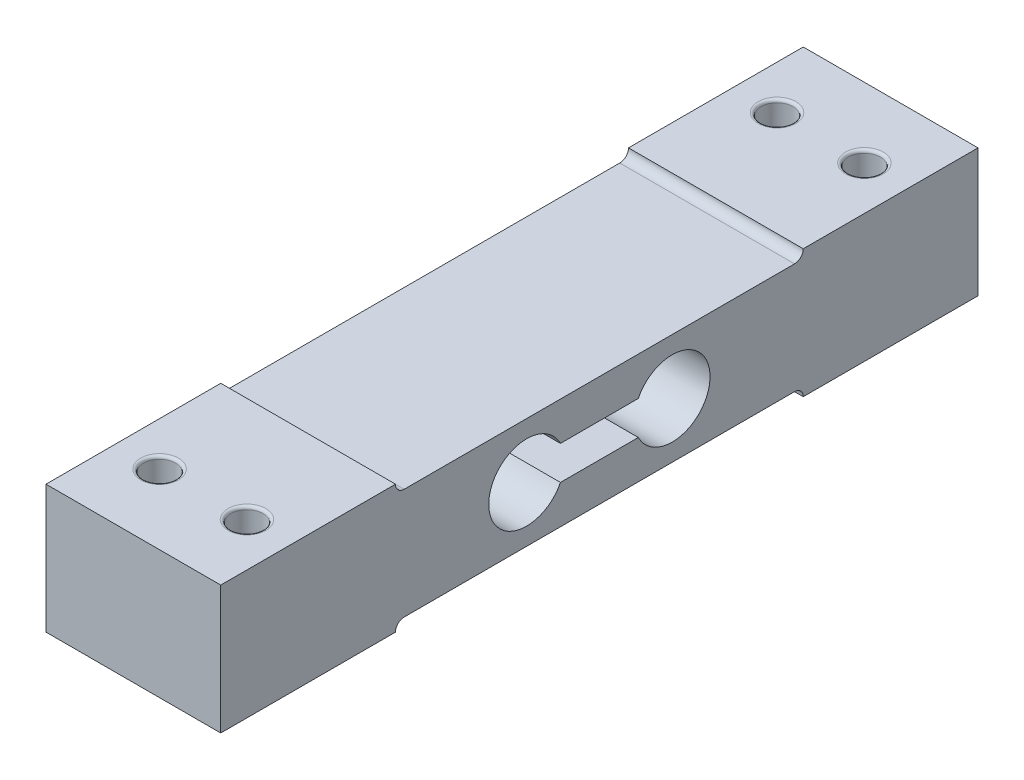
ISO-10303-21;
HEADER;
FILE_DESCRIPTION(('STEP AP214'),'2;1');
FILE_NAME('part.step','',(''),(''),'','','');
FILE_SCHEMA(('AUTOMOTIVE_DESIGN { 1 0 10303 214 1 1 1 1 }'));
ENDSEC;
DATA;
#1=APPLICATION_CONTEXT('core data for automotive mechanical design processes');
#2=APPLICATION_PROTOCOL_DEFINITION('international standard','automotive_design',2000,#1);
#3=PRODUCT_CONTEXT('',#1,'mechanical');
#4=PRODUCT('Part','Part','',(#3));
#5=PRODUCT_RELATED_PRODUCT_CATEGORY('part','',(#4));
#6=PRODUCT_DEFINITION_FORMATION('','',#4);
#7=PRODUCT_DEFINITION_CONTEXT('part definition',#1,'design');
#8=PRODUCT_DEFINITION('design','',#6,#7);
#9=PRODUCT_DEFINITION_SHAPE('','',#8);
#10=(LENGTH_UNIT() NAMED_UNIT(*) SI_UNIT(.MILLI.,.METRE.));
#11=(NAMED_UNIT(*) PLANE_ANGLE_UNIT() SI_UNIT($,.RADIAN.));
#12=(NAMED_UNIT(*) SI_UNIT($,.STERADIAN.) SOLID_ANGLE_UNIT());
#13=UNCERTAINTY_MEASURE_WITH_UNIT(LENGTH_MEASURE(1.E-05),#10,'distance_accuracy_value','');
#14=(GEOMETRIC_REPRESENTATION_CONTEXT(3) GLOBAL_UNCERTAINTY_ASSIGNED_CONTEXT((#13)) GLOBAL_UNIT_ASSIGNED_CONTEXT((#10,
#11,#12)) REPRESENTATION_CONTEXT('',''));
#15=CARTESIAN_POINT('',(0.,0.,0.));
#16=DIRECTION('',(0.,0.,1.));
#17=DIRECTION('',(1.,0.,0.));
#18=AXIS2_PLACEMENT_3D('',#15,#16,#17);
#19=CARTESIAN_POINT('',(30.,0.,-12.5));
#20=DIRECTION('',(-1.,0.,0.));
#21=DIRECTION('',(0.,0.,1.));
#22=AXIS2_PLACEMENT_3D('',#19,#20,#21);
#23=CYLINDRICAL_SURFACE('',#22,6.5);
#24=CARTESIAN_POINT('',(0.,0.,-12.5));
#25=DIRECTION('',(1.,0.,0.));
#26=DIRECTION('',(0.,0.,-1.));
#27=AXIS2_PLACEMENT_3D('',#24,#25,#26);
#28=CIRCLE('',#27,6.5);
#29=CARTESIAN_POINT('',(0.,-2.9,-6.68278417110041));
#30=VERTEX_POINT('',#29);
#31=CARTESIAN_POINT('',(0.,2.9,-6.68278417110041));
#32=VERTEX_POINT('',#31);
#33=EDGE_CURVE('E400',#30,#32,#28,.T.);
#34=ORIENTED_EDGE('',*,*,#33,.F.);
#35=DIRECTION('',(-1.,0.,0.));
#36=VECTOR('',#35,1.);
#37=CARTESIAN_POINT('',(30.,-2.9,-6.68278417110041));
#38=LINE('',#37,#36);
#39=CARTESIAN_POINT('',(30.,-2.9,-6.68278417110041));
#40=VERTEX_POINT('',#39);
#41=EDGE_CURVE('E182',#40,#30,#38,.T.);
#42=ORIENTED_EDGE('',*,*,#41,.F.);
#43=CARTESIAN_POINT('',(30.,0.,-12.5));
#44=DIRECTION('',(1.,0.,0.));
#45=DIRECTION('',(0.,0.,-1.));
#46=AXIS2_PLACEMENT_3D('',#43,#44,#45);
#47=CIRCLE('',#46,6.5);
#48=CARTESIAN_POINT('',(30.,2.9,-6.68278417110041));
#49=VERTEX_POINT('',#48);
#50=EDGE_CURVE('E427',#40,#49,#47,.T.);
#51=ORIENTED_EDGE('',*,*,#50,.T.);
#52=DIRECTION('',(-1.,0.,0.));
#53=VECTOR('',#52,1.);
#54=CARTESIAN_POINT('',(30.,2.9,-6.68278417110041));
#55=LINE('',#54,#53);
#56=EDGE_CURVE('E171',#49,#32,#55,.T.);
#57=ORIENTED_EDGE('',*,*,#56,.T.);
#58=EDGE_LOOP('',(#34,#42,#51,#57));
#59=FACE_BOUND('',#58,.T.);
#60=ADVANCED_FACE('F34',(#59),#23,.F.);
#61=CARTESIAN_POINT('',(30.,-2.9,0.));
#62=DIRECTION('',(0.,1.,0.));
#63=DIRECTION('',(0.,0.,1.));
#64=AXIS2_PLACEMENT_3D('',#61,#62,#63);
#65=PLANE('',#64);
#66=DIRECTION('',(0.,0.,-1.));
#67=VECTOR('',#66,1.);
#68=CARTESIAN_POINT('',(0.,-2.9,0.));
#69=LINE('',#68,#67);
#70=CARTESIAN_POINT('',(0.,-2.9,6.68278417110041));
#71=VERTEX_POINT('',#70);
#72=EDGE_CURVE('E403',#71,#30,#69,.T.);
#73=ORIENTED_EDGE('',*,*,#72,.F.);
#74=DIRECTION('',(-1.,0.,0.));
#75=VECTOR('',#74,1.);
#76=CARTESIAN_POINT('',(30.,-2.9,6.68278417110041));
#77=LINE('',#76,#75);
#78=CARTESIAN_POINT('',(30.,-2.9,6.68278417110041));
#79=VERTEX_POINT('',#78);
#80=EDGE_CURVE('E411',#79,#71,#77,.T.);
#81=ORIENTED_EDGE('',*,*,#80,.F.);
#82=DIRECTION('',(0.,0.,-1.));
#83=VECTOR('',#82,1.);
#84=CARTESIAN_POINT('',(30.,-2.9,0.));
#85=LINE('',#84,#83);
#86=EDGE_CURVE('E418',#79,#40,#85,.T.);
#87=ORIENTED_EDGE('',*,*,#86,.T.);
#88=ORIENTED_EDGE('',*,*,#41,.T.);
#89=EDGE_LOOP('',(#73,#81,#87,#88));
#90=FACE_BOUND('',#89,.T.);
#91=ADVANCED_FACE('F255',(#90),#65,.T.);
#92=CARTESIAN_POINT('',(30.,0.,12.5));
#93=DIRECTION('',(-1.,0.,0.));
#94=DIRECTION('',(0.,0.,1.));
#95=AXIS2_PLACEMENT_3D('',#92,#93,#94);
#96=CYLINDRICAL_SURFACE('',#95,6.5);
#97=CARTESIAN_POINT('',(0.,0.,12.5));
#98=DIRECTION('',(1.,0.,0.));
#99=DIRECTION('',(0.,0.,-1.));
#100=AXIS2_PLACEMENT_3D('',#97,#98,#99);
#101=CIRCLE('',#100,6.5);
#102=CARTESIAN_POINT('',(0.,2.9,6.6827841711004));
#103=VERTEX_POINT('',#102);
#104=EDGE_CURVE('E406',#103,#71,#101,.T.);
#105=ORIENTED_EDGE('',*,*,#104,.F.);
#106=DIRECTION('',(-1.,0.,0.));
#107=VECTOR('',#106,1.);
#108=CARTESIAN_POINT('',(30.,2.9,6.6827841711004));
#109=LINE('',#108,#107);
#110=CARTESIAN_POINT('',(30.,2.9,6.6827841711004));
#111=VERTEX_POINT('',#110);
#112=EDGE_CURVE('E173',#111,#103,#109,.T.);
#113=ORIENTED_EDGE('',*,*,#112,.F.);
#114=CARTESIAN_POINT('',(30.,0.,12.5));
#115=DIRECTION('',(1.,0.,0.));
#116=DIRECTION('',(0.,0.,-1.));
#117=AXIS2_PLACEMENT_3D('',#114,#115,#116);
#118=CIRCLE('',#117,6.5);
#119=EDGE_CURVE('E362',#111,#79,#118,.T.);
#120=ORIENTED_EDGE('',*,*,#119,.T.);
#121=ORIENTED_EDGE('',*,*,#80,.T.);
#122=EDGE_LOOP('',(#105,#113,#120,#121));
#123=FACE_BOUND('',#122,.T.);
#124=ADVANCED_FACE('F261',(#123),#96,.F.);
#125=CARTESIAN_POINT('',(30.,11.,0.));
#126=DIRECTION('',(0.,1.,0.));
#127=DIRECTION('',(0.,0.,1.));
#128=AXIS2_PLACEMENT_3D('',#125,#126,#127);
#129=PLANE('',#128);
#130=CARTESIAN_POINT('',(22.5,11.,53.));
#131=DIRECTION('',(0.,1.,0.));
#132=DIRECTION('',(0.,0.,1.));
#133=AXIS2_PLACEMENT_3D('',#130,#131,#132);
#134=CIRCLE('',#133,3.25);
#135=CARTESIAN_POINT('',(22.5,11.,56.25));
#136=VERTEX_POINT('',#135);
#137=EDGE_CURVE('E11',#136,#136,#134,.F.);
#138=ORIENTED_EDGE('',*,*,#137,.T.);
#139=EDGE_LOOP('',(#138));
#140=FACE_BOUND('',#139,.T.);
#141=CARTESIAN_POINT('',(7.5,11.,53.));
#142=DIRECTION('',(0.,1.,0.));
#143=DIRECTION('',(0.,0.,1.));
#144=AXIS2_PLACEMENT_3D('',#141,#142,#143);
#145=CIRCLE('',#144,3.25);
#146=CARTESIAN_POINT('',(7.5,11.,56.25));
#147=VERTEX_POINT('',#146);
#148=EDGE_CURVE('E42',#147,#147,#145,.F.);
#149=ORIENTED_EDGE('',*,*,#148,.T.);
#150=EDGE_LOOP('',(#149));
#151=FACE_BOUND('',#150,.T.);
#152=DIRECTION('',(0.,0.,-1.));
#153=VECTOR('',#152,1.);
#154=CARTESIAN_POINT('',(0.,11.,0.));
#155=LINE('',#154,#153);
#156=CARTESIAN_POINT('',(0.,11.,65.));
#157=VERTEX_POINT('',#156);
#158=CARTESIAN_POINT('',(0.,11.,35.));
#159=VERTEX_POINT('',#158);
#160=EDGE_CURVE('E391',#157,#159,#155,.T.);
#161=ORIENTED_EDGE('',*,*,#160,.F.);
#162=DIRECTION('',(-1.,0.,0.));
#163=VECTOR('',#162,1.);
#164=CARTESIAN_POINT('',(30.,11.,65.));
#165=LINE('',#164,#163);
#166=CARTESIAN_POINT('',(30.,11.,65.));
#167=VERTEX_POINT('',#166);
#168=EDGE_CURVE('E165',#167,#157,#165,.T.);
#169=ORIENTED_EDGE('',*,*,#168,.F.);
#170=DIRECTION('',(0.,0.,-1.));
#171=VECTOR('',#170,1.);
#172=CARTESIAN_POINT('',(30.,11.,0.));
#173=LINE('',#172,#171);
#174=CARTESIAN_POINT('',(30.,11.,35.));
#175=VERTEX_POINT('',#174);
#176=EDGE_CURVE('E152',#167,#175,#173,.T.);
#177=ORIENTED_EDGE('',*,*,#176,.T.);
#178=DIRECTION('',(-1.,0.,0.));
#179=VECTOR('',#178,1.);
#180=CARTESIAN_POINT('',(30.,11.,35.));
#181=LINE('',#180,#179);
#182=EDGE_CURVE('E163',#175,#159,#181,.T.);
#183=ORIENTED_EDGE('',*,*,#182,.T.);
#184=EDGE_LOOP('',(#161,#169,#177,#183));
#185=FACE_BOUND('',#184,.T.);
#186=ADVANCED_FACE('F162',(#140,#151,#185),#129,.T.);
#187=CARTESIAN_POINT('',(30.,0.,65.));
#188=DIRECTION('',(0.,0.,-1.));
#189=DIRECTION('',(-1.,0.,0.));
#190=AXIS2_PLACEMENT_3D('',#187,#188,#189);
#191=PLANE('',#190);
#192=DIRECTION('',(0.,-1.,0.));
#193=VECTOR('',#192,1.);
#194=CARTESIAN_POINT('',(0.,0.,65.));
#195=LINE('',#194,#193);
#196=CARTESIAN_POINT('',(0.,-11.,65.));
#197=VERTEX_POINT('',#196);
#198=EDGE_CURVE('E384',#157,#197,#195,.T.);
#199=ORIENTED_EDGE('',*,*,#198,.T.);
#200=DIRECTION('',(-1.,0.,0.));
#201=VECTOR('',#200,1.);
#202=CARTESIAN_POINT('',(30.,-11.,65.));
#203=LINE('',#202,#201);
#204=CARTESIAN_POINT('',(30.,-11.,65.));
#205=VERTEX_POINT('',#204);
#206=EDGE_CURVE('E175',#205,#197,#203,.T.);
#207=ORIENTED_EDGE('',*,*,#206,.F.);
#208=DIRECTION('',(0.,-1.,0.));
#209=VECTOR('',#208,1.);
#210=CARTESIAN_POINT('',(30.,0.,65.));
#211=LINE('',#210,#209);
#212=EDGE_CURVE('E167',#167,#205,#211,.T.);
#213=ORIENTED_EDGE('',*,*,#212,.F.);
#214=ORIENTED_EDGE('',*,*,#168,.T.);
#215=EDGE_LOOP('',(#199,#207,#213,#214));
#216=FACE_BOUND('',#215,.T.);
#217=ADVANCED_FACE('F290',(#216),#191,.F.);
#218=CARTESIAN_POINT('',(30.,-11.,0.));
#219=DIRECTION('',(0.,1.,0.));
#220=DIRECTION('',(0.,0.,1.));
#221=AXIS2_PLACEMENT_3D('',#218,#219,#220);
#222=PLANE('',#221);
#223=CARTESIAN_POINT('',(22.5,-11.,53.));
#224=DIRECTION('',(0.,1.,0.));
#225=DIRECTION('',(0.,0.,1.));
#226=AXIS2_PLACEMENT_3D('',#223,#224,#225);
#227=CIRCLE('',#226,3.25);
#228=CARTESIAN_POINT('',(22.5,-11.,56.25));
#229=VERTEX_POINT('',#228);
#230=EDGE_CURVE('E203',#229,#229,#227,.T.);
#231=ORIENTED_EDGE('',*,*,#230,.T.);
#232=EDGE_LOOP('',(#231));
#233=FACE_BOUND('',#232,.T.);
#234=CARTESIAN_POINT('',(7.5,-11.,53.));
#235=DIRECTION('',(0.,1.,0.));
#236=DIRECTION('',(0.,0.,1.));
#237=AXIS2_PLACEMENT_3D('',#234,#235,#236);
#238=CIRCLE('',#237,3.25);
#239=CARTESIAN_POINT('',(7.5,-11.,56.25));
#240=VERTEX_POINT('',#239);
#241=EDGE_CURVE('E156',#240,#240,#238,.T.);
#242=ORIENTED_EDGE('',*,*,#241,.T.);
#243=EDGE_LOOP('',(#242));
#244=FACE_BOUND('',#243,.T.);
#245=DIRECTION('',(0.,0.,-1.));
#246=VECTOR('',#245,1.);
#247=CARTESIAN_POINT('',(0.,-11.,0.));
#248=LINE('',#247,#246);
#249=CARTESIAN_POINT('',(0.,-11.,35.));
#250=VERTEX_POINT('',#249);
#251=EDGE_CURVE('E380',#197,#250,#248,.T.);
#252=ORIENTED_EDGE('',*,*,#251,.T.);
#253=DIRECTION('',(-1.,0.,0.));
#254=VECTOR('',#253,1.);
#255=CARTESIAN_POINT('',(30.,-11.,35.));
#256=LINE('',#255,#254);
#257=CARTESIAN_POINT('',(30.,-11.,35.));
#258=VERTEX_POINT('',#257);
#259=EDGE_CURVE('E371',#258,#250,#256,.T.);
#260=ORIENTED_EDGE('',*,*,#259,.F.);
#261=DIRECTION('',(0.,0.,-1.));
#262=VECTOR('',#261,1.);
#263=CARTESIAN_POINT('',(30.,-11.,0.));
#264=LINE('',#263,#262);
#265=EDGE_CURVE('E381',#205,#258,#264,.T.);
#266=ORIENTED_EDGE('',*,*,#265,.F.);
#267=ORIENTED_EDGE('',*,*,#206,.T.);
#268=EDGE_LOOP('',(#252,#260,#266,#267));
#269=FACE_BOUND('',#268,.T.);
#270=ADVANCED_FACE('F286',(#233,#244,#269),#222,.F.);
#271=CARTESIAN_POINT('',(30.,-9.49999999999999,0.));
#272=DIRECTION('',(0.,1.,0.));
#273=DIRECTION('',(0.,0.,1.));
#274=AXIS2_PLACEMENT_3D('',#271,#272,#273);
#275=PLANE('',#274);
#276=DIRECTION('',(0.,0.,-1.));
#277=VECTOR('',#276,1.);
#278=CARTESIAN_POINT('',(30.,-9.49999999999999,0.));
#279=LINE('',#278,#277);
#280=CARTESIAN_POINT('',(30.,-9.49999999999999,33.5));
#281=VERTEX_POINT('',#280);
#282=CARTESIAN_POINT('',(30.,-9.49999999999999,-33.5));
#283=VERTEX_POINT('',#282);
#284=EDGE_CURVE('E439',#281,#283,#279,.T.);
#285=ORIENTED_EDGE('',*,*,#284,.F.);
#286=DIRECTION('',(-1.,0.,0.));
#287=VECTOR('',#286,1.);
#288=CARTESIAN_POINT('',(30.,-9.49999999999999,33.5));
#289=LINE('',#288,#287);
#290=CARTESIAN_POINT('',(0.,-9.49999999999999,33.5));
#291=VERTEX_POINT('',#290);
#292=EDGE_CURVE('E181',#281,#291,#289,.T.);
#293=ORIENTED_EDGE('',*,*,#292,.T.);
#294=DIRECTION('',(0.,0.,-1.));
#295=VECTOR('',#294,1.);
#296=CARTESIAN_POINT('',(0.,-9.49999999999999,0.));
#297=LINE('',#296,#295);
#298=CARTESIAN_POINT('',(0.,-9.49999999999999,-33.5));
#299=VERTEX_POINT('',#298);
#300=EDGE_CURVE('E386',#291,#299,#297,.T.);
#301=ORIENTED_EDGE('',*,*,#300,.T.);
#302=DIRECTION('',(-1.,0.,0.));
#303=VECTOR('',#302,1.);
#304=CARTESIAN_POINT('',(30.,-9.49999999999999,-33.5));
#305=LINE('',#304,#303);
#306=EDGE_CURVE('E179',#299,#283,#305,.F.);
#307=ORIENTED_EDGE('',*,*,#306,.T.);
#308=EDGE_LOOP('',(#285,#293,#301,#307));
#309=FACE_BOUND('',#308,.T.);
#310=ADVANCED_FACE('F282',(#309),#275,.F.);
#311=CARTESIAN_POINT('',(30.,-11.,0.));
#312=DIRECTION('',(0.,1.,0.));
#313=DIRECTION('',(0.,0.,1.));
#314=AXIS2_PLACEMENT_3D('',#311,#312,#313);
#315=PLANE('',#314);
#316=CARTESIAN_POINT('',(7.5,-11.,-53.));
#317=DIRECTION('',(0.,1.,0.));
#318=DIRECTION('',(0.,0.,1.));
#319=AXIS2_PLACEMENT_3D('',#316,#317,#318);
#320=CIRCLE('',#319,3.25);
#321=CARTESIAN_POINT('',(7.5,-11.,-49.75));
#322=VERTEX_POINT('',#321);
#323=EDGE_CURVE('E221',#322,#322,#320,.T.);
#324=ORIENTED_EDGE('',*,*,#323,.T.);
#325=EDGE_LOOP('',(#324));
#326=FACE_BOUND('',#325,.T.);
#327=CARTESIAN_POINT('',(22.5,-11.,-53.));
#328=DIRECTION('',(0.,1.,0.));
#329=DIRECTION('',(0.,0.,1.));
#330=AXIS2_PLACEMENT_3D('',#327,#328,#329);
#331=CIRCLE('',#330,3.25);
#332=CARTESIAN_POINT('',(22.5,-11.,-49.75));
#333=VERTEX_POINT('',#332);
#334=EDGE_CURVE('E218',#333,#333,#331,.T.);
#335=ORIENTED_EDGE('',*,*,#334,.T.);
#336=EDGE_LOOP('',(#335));
#337=FACE_BOUND('',#336,.T.);
#338=DIRECTION('',(0.,0.,-1.));
#339=VECTOR('',#338,1.);
#340=CARTESIAN_POINT('',(0.,-11.,0.));
#341=LINE('',#340,#339);
#342=CARTESIAN_POINT('',(0.,-11.,-35.));
#343=VERTEX_POINT('',#342);
#344=CARTESIAN_POINT('',(0.,-11.,-65.));
#345=VERTEX_POINT('',#344);
#346=EDGE_CURVE('E389',#343,#345,#341,.T.);
#347=ORIENTED_EDGE('',*,*,#346,.T.);
#348=DIRECTION('',(-1.,0.,0.));
#349=VECTOR('',#348,1.);
#350=CARTESIAN_POINT('',(30.,-11.,-65.));
#351=LINE('',#350,#349);
#352=CARTESIAN_POINT('',(30.,-11.,-65.));
#353=VERTEX_POINT('',#352);
#354=EDGE_CURVE('E360',#353,#345,#351,.T.);
#355=ORIENTED_EDGE('',*,*,#354,.F.);
#356=DIRECTION('',(0.,0.,-1.));
#357=VECTOR('',#356,1.);
#358=CARTESIAN_POINT('',(30.,-11.,0.));
#359=LINE('',#358,#357);
#360=CARTESIAN_POINT('',(30.,-11.,-35.));
#361=VERTEX_POINT('',#360);
#362=EDGE_CURVE('E437',#361,#353,#359,.T.);
#363=ORIENTED_EDGE('',*,*,#362,.F.);
#364=DIRECTION('',(-1.,0.,0.));
#365=VECTOR('',#364,1.);
#366=CARTESIAN_POINT('',(30.,-11.,-35.));
#367=LINE('',#366,#365);
#368=EDGE_CURVE('E368',#361,#343,#367,.T.);
#369=ORIENTED_EDGE('',*,*,#368,.T.);
#370=EDGE_LOOP('',(#347,#355,#363,#369));
#371=FACE_BOUND('',#370,.T.);
#372=ADVANCED_FACE('F278',(#326,#337,#371),#315,.F.);
#373=CARTESIAN_POINT('',(30.,0.,-65.));
#374=DIRECTION('',(0.,0.,-1.));
#375=DIRECTION('',(-1.,0.,0.));
#376=AXIS2_PLACEMENT_3D('',#373,#374,#375);
#377=PLANE('',#376);
#378=DIRECTION('',(0.,-1.,0.));
#379=VECTOR('',#378,1.);
#380=CARTESIAN_POINT('',(0.,0.,-65.));
#381=LINE('',#380,#379);
#382=CARTESIAN_POINT('',(0.,11.,-65.));
#383=VERTEX_POINT('',#382);
#384=EDGE_CURVE('E355',#383,#345,#381,.T.);
#385=ORIENTED_EDGE('',*,*,#384,.F.);
#386=DIRECTION('',(-1.,0.,0.));
#387=VECTOR('',#386,1.);
#388=CARTESIAN_POINT('',(30.,11.,-65.));
#389=LINE('',#388,#387);
#390=CARTESIAN_POINT('',(30.,11.,-65.));
#391=VERTEX_POINT('',#390);
#392=EDGE_CURVE('E350',#391,#383,#389,.T.);
#393=ORIENTED_EDGE('',*,*,#392,.F.);
#394=DIRECTION('',(0.,-1.,0.));
#395=VECTOR('',#394,1.);
#396=CARTESIAN_POINT('',(30.,0.,-65.));
#397=LINE('',#396,#395);
#398=EDGE_CURVE('E432',#391,#353,#397,.T.);
#399=ORIENTED_EDGE('',*,*,#398,.T.);
#400=ORIENTED_EDGE('',*,*,#354,.T.);
#401=EDGE_LOOP('',(#385,#393,#399,#400));
#402=FACE_BOUND('',#401,.T.);
#403=ADVANCED_FACE('F274',(#402),#377,.T.);
#404=CARTESIAN_POINT('',(30.,11.,0.));
#405=DIRECTION('',(0.,1.,0.));
#406=DIRECTION('',(0.,0.,1.));
#407=AXIS2_PLACEMENT_3D('',#404,#405,#406);
#408=PLANE('',#407);
#409=CARTESIAN_POINT('',(7.5,11.,-53.));
#410=DIRECTION('',(0.,1.,0.));
#411=DIRECTION('',(0.,0.,1.));
#412=AXIS2_PLACEMENT_3D('',#409,#410,#411);
#413=CIRCLE('',#412,3.25);
#414=CARTESIAN_POINT('',(7.5,11.,-49.75));
#415=VERTEX_POINT('',#414);
#416=EDGE_CURVE('E239',#415,#415,#413,.F.);
#417=ORIENTED_EDGE('',*,*,#416,.T.);
#418=EDGE_LOOP('',(#417));
#419=FACE_BOUND('',#418,.T.);
#420=CARTESIAN_POINT('',(22.5,11.,-53.));
#421=DIRECTION('',(0.,1.,0.));
#422=DIRECTION('',(0.,0.,1.));
#423=AXIS2_PLACEMENT_3D('',#420,#421,#422);
#424=CIRCLE('',#423,3.25);
#425=CARTESIAN_POINT('',(22.5,11.,-49.75));
#426=VERTEX_POINT('',#425);
#427=EDGE_CURVE('E236',#426,#426,#424,.F.);
#428=ORIENTED_EDGE('',*,*,#427,.T.);
#429=EDGE_LOOP('',(#428));
#430=FACE_BOUND('',#429,.T.);
#431=DIRECTION('',(0.,0.,-1.));
#432=VECTOR('',#431,1.);
#433=CARTESIAN_POINT('',(0.,11.,0.));
#434=LINE('',#433,#432);
#435=CARTESIAN_POINT('',(0.,11.,-35.));
#436=VERTEX_POINT('',#435);
#437=EDGE_CURVE('E346',#436,#383,#434,.T.);
#438=ORIENTED_EDGE('',*,*,#437,.F.);
#439=DIRECTION('',(-1.,0.,0.));
#440=VECTOR('',#439,1.);
#441=CARTESIAN_POINT('',(30.,11.,-35.));
#442=LINE('',#441,#440);
#443=CARTESIAN_POINT('',(30.,11.,-35.));
#444=VERTEX_POINT('',#443);
#445=EDGE_CURVE('E349',#444,#436,#442,.T.);
#446=ORIENTED_EDGE('',*,*,#445,.F.);
#447=DIRECTION('',(0.,0.,-1.));
#448=VECTOR('',#447,1.);
#449=CARTESIAN_POINT('',(30.,11.,0.));
#450=LINE('',#449,#448);
#451=EDGE_CURVE('E430',#444,#391,#450,.T.);
#452=ORIENTED_EDGE('',*,*,#451,.T.);
#453=ORIENTED_EDGE('',*,*,#392,.T.);
#454=EDGE_LOOP('',(#438,#446,#452,#453));
#455=FACE_BOUND('',#454,.T.);
#456=ADVANCED_FACE('F271',(#419,#430,#455),#408,.T.);
#457=CARTESIAN_POINT('',(30.,9.5,0.));
#458=DIRECTION('',(0.,1.,0.));
#459=DIRECTION('',(0.,0.,1.));
#460=AXIS2_PLACEMENT_3D('',#457,#458,#459);
#461=PLANE('',#460);
#462=DIRECTION('',(0.,0.,-1.));
#463=VECTOR('',#462,1.);
#464=CARTESIAN_POINT('',(30.,9.5,0.));
#465=LINE('',#464,#463);
#466=CARTESIAN_POINT('',(30.,9.5,33.5));
#467=VERTEX_POINT('',#466);
#468=CARTESIAN_POINT('',(30.,9.5,-33.5));
#469=VERTEX_POINT('',#468);
#470=EDGE_CURVE('E153',#467,#469,#465,.T.);
#471=ORIENTED_EDGE('',*,*,#470,.T.);
#472=DIRECTION('',(-1.,0.,0.));
#473=VECTOR('',#472,1.);
#474=CARTESIAN_POINT('',(30.,9.5,-33.5));
#475=LINE('',#474,#473);
#476=CARTESIAN_POINT('',(0.,9.5,-33.5));
#477=VERTEX_POINT('',#476);
#478=EDGE_CURVE('E186',#469,#477,#475,.T.);
#479=ORIENTED_EDGE('',*,*,#478,.T.);
#480=DIRECTION('',(0.,0.,-1.));
#481=VECTOR('',#480,1.);
#482=CARTESIAN_POINT('',(0.,9.5,0.));
#483=LINE('',#482,#481);
#484=CARTESIAN_POINT('',(0.,9.5,33.5));
#485=VERTEX_POINT('',#484);
#486=EDGE_CURVE('E354',#485,#477,#483,.T.);
#487=ORIENTED_EDGE('',*,*,#486,.F.);
#488=DIRECTION('',(-1.,0.,0.));
#489=VECTOR('',#488,1.);
#490=CARTESIAN_POINT('',(30.,9.5,33.5));
#491=LINE('',#490,#489);
#492=EDGE_CURVE('E56',#485,#467,#491,.F.);
#493=ORIENTED_EDGE('',*,*,#492,.T.);
#494=EDGE_LOOP('',(#471,#479,#487,#493));
#495=FACE_BOUND('',#494,.T.);
#496=ADVANCED_FACE('F267',(#495),#461,.T.);
#497=CARTESIAN_POINT('',(30.,2.9,0.));
#498=DIRECTION('',(0.,1.,0.));
#499=DIRECTION('',(0.,0.,1.));
#500=AXIS2_PLACEMENT_3D('',#497,#498,#499);
#501=PLANE('',#500);
#502=DIRECTION('',(0.,0.,-1.));
#503=VECTOR('',#502,1.);
#504=CARTESIAN_POINT('',(0.,2.9,0.));
#505=LINE('',#504,#503);
#506=EDGE_CURVE('E168',#103,#32,#505,.T.);
#507=ORIENTED_EDGE('',*,*,#506,.T.);
#508=ORIENTED_EDGE('',*,*,#56,.F.);
#509=DIRECTION('',(0.,0.,-1.));
#510=VECTOR('',#509,1.);
#511=CARTESIAN_POINT('',(30.,2.9,0.));
#512=LINE('',#511,#510);
#513=EDGE_CURVE('E358',#111,#49,#512,.T.);
#514=ORIENTED_EDGE('',*,*,#513,.F.);
#515=ORIENTED_EDGE('',*,*,#112,.T.);
#516=EDGE_LOOP('',(#507,#508,#514,#515));
#517=FACE_BOUND('',#516,.T.);
#518=ADVANCED_FACE('F270',(#517),#501,.F.);
#519=CARTESIAN_POINT('',(30.,0.,0.));
#520=DIRECTION('',(1.,0.,0.));
#521=DIRECTION('',(0.,0.,-1.));
#522=AXIS2_PLACEMENT_3D('',#519,#520,#521);
#523=PLANE('',#522);
#524=ORIENTED_EDGE('',*,*,#470,.F.);
#525=CARTESIAN_POINT('',(30.,11.,33.5));
#526=DIRECTION('',(1.,0.,0.));
#527=DIRECTION('',(0.,0.,-1.));
#528=AXIS2_PLACEMENT_3D('',#525,#526,#527);
#529=CIRCLE('',#528,1.5);
#530=EDGE_CURVE('E148',#467,#175,#529,.F.);
#531=ORIENTED_EDGE('',*,*,#530,.T.);
#532=ORIENTED_EDGE('',*,*,#176,.F.);
#533=ORIENTED_EDGE('',*,*,#212,.T.);
#534=ORIENTED_EDGE('',*,*,#265,.T.);
#535=CARTESIAN_POINT('',(30.,-11.,33.5));
#536=DIRECTION('',(1.,0.,0.));
#537=DIRECTION('',(0.,0.,-1.));
#538=AXIS2_PLACEMENT_3D('',#535,#536,#537);
#539=CIRCLE('',#538,1.5);
#540=EDGE_CURVE('E191',#258,#281,#539,.F.);
#541=ORIENTED_EDGE('',*,*,#540,.T.);
#542=ORIENTED_EDGE('',*,*,#284,.T.);
#543=CARTESIAN_POINT('',(30.,-11.,-33.5));
#544=DIRECTION('',(1.,0.,0.));
#545=DIRECTION('',(0.,0.,-1.));
#546=AXIS2_PLACEMENT_3D('',#543,#544,#545);
#547=CIRCLE('',#546,1.5);
#548=EDGE_CURVE('E195',#283,#361,#547,.F.);
#549=ORIENTED_EDGE('',*,*,#548,.T.);
#550=ORIENTED_EDGE('',*,*,#362,.T.);
#551=ORIENTED_EDGE('',*,*,#398,.F.);
#552=ORIENTED_EDGE('',*,*,#451,.F.);
#553=CARTESIAN_POINT('',(30.,11.,-33.5));
#554=DIRECTION('',(1.,0.,0.));
#555=DIRECTION('',(0.,0.,-1.));
#556=AXIS2_PLACEMENT_3D('',#553,#554,#555);
#557=CIRCLE('',#556,1.5);
#558=EDGE_CURVE('E49',#444,#469,#557,.F.);
#559=ORIENTED_EDGE('',*,*,#558,.T.);
#560=EDGE_LOOP('',(#524,#531,#532,#533,#534,#541,#542,#549,#550,#551,#552,#559));
#561=FACE_BOUND('',#560,.T.);
#562=ORIENTED_EDGE('',*,*,#50,.F.);
#563=ORIENTED_EDGE('',*,*,#86,.F.);
#564=ORIENTED_EDGE('',*,*,#119,.F.);
#565=ORIENTED_EDGE('',*,*,#513,.T.);
#566=EDGE_LOOP('',(#562,#563,#564,#565));
#567=FACE_BOUND('',#566,.T.);
#568=ADVANCED_FACE('F150',(#561,#567),#523,.T.);
#569=CARTESIAN_POINT('',(0.,0.,0.));
#570=DIRECTION('',(1.,0.,0.));
#571=DIRECTION('',(0.,0.,-1.));
#572=AXIS2_PLACEMENT_3D('',#569,#570,#571);
#573=PLANE('',#572);
#574=ORIENTED_EDGE('',*,*,#160,.T.);
#575=CARTESIAN_POINT('',(0.,11.,33.5));
#576=DIRECTION('',(1.,0.,0.));
#577=DIRECTION('',(0.,0.,-1.));
#578=AXIS2_PLACEMENT_3D('',#575,#576,#577);
#579=CIRCLE('',#578,1.5);
#580=EDGE_CURVE('E157',#159,#485,#579,.T.);
#581=ORIENTED_EDGE('',*,*,#580,.T.);
#582=ORIENTED_EDGE('',*,*,#486,.T.);
#583=CARTESIAN_POINT('',(0.,11.,-33.5));
#584=DIRECTION('',(1.,0.,0.));
#585=DIRECTION('',(0.,0.,-1.));
#586=AXIS2_PLACEMENT_3D('',#583,#584,#585);
#587=CIRCLE('',#586,1.5);
#588=EDGE_CURVE('E197',#477,#436,#587,.T.);
#589=ORIENTED_EDGE('',*,*,#588,.T.);
#590=ORIENTED_EDGE('',*,*,#437,.T.);
#591=ORIENTED_EDGE('',*,*,#384,.T.);
#592=ORIENTED_EDGE('',*,*,#346,.F.);
#593=CARTESIAN_POINT('',(0.,-11.,-33.5));
#594=DIRECTION('',(1.,0.,0.));
#595=DIRECTION('',(0.,0.,-1.));
#596=AXIS2_PLACEMENT_3D('',#593,#594,#595);
#597=CIRCLE('',#596,1.5);
#598=EDGE_CURVE('E193',#343,#299,#597,.T.);
#599=ORIENTED_EDGE('',*,*,#598,.T.);
#600=ORIENTED_EDGE('',*,*,#300,.F.);
#601=CARTESIAN_POINT('',(0.,-11.,33.5));
#602=DIRECTION('',(1.,0.,0.));
#603=DIRECTION('',(0.,0.,-1.));
#604=AXIS2_PLACEMENT_3D('',#601,#602,#603);
#605=CIRCLE('',#604,1.5);
#606=EDGE_CURVE('E189',#291,#250,#605,.T.);
#607=ORIENTED_EDGE('',*,*,#606,.T.);
#608=ORIENTED_EDGE('',*,*,#251,.F.);
#609=ORIENTED_EDGE('',*,*,#198,.F.);
#610=EDGE_LOOP('',(#574,#581,#582,#589,#590,#591,#592,#599,#600,#607,#608,#609));
#611=FACE_BOUND('',#610,.T.);
#612=ORIENTED_EDGE('',*,*,#33,.T.);
#613=ORIENTED_EDGE('',*,*,#506,.F.);
#614=ORIENTED_EDGE('',*,*,#104,.T.);
#615=ORIENTED_EDGE('',*,*,#72,.T.);
#616=EDGE_LOOP('',(#612,#613,#614,#615));
#617=FACE_BOUND('',#616,.T.);
#618=ADVANCED_FACE('F302',(#611,#617),#573,.F.);
#619=CARTESIAN_POINT('',(30.,-11.,33.5));
#620=DIRECTION('',(-1.,0.,0.));
#621=DIRECTION('',(0.,0.,1.));
#622=AXIS2_PLACEMENT_3D('',#619,#620,#621);
#623=CYLINDRICAL_SURFACE('',#622,1.5);
#624=ORIENTED_EDGE('',*,*,#540,.F.);
#625=ORIENTED_EDGE('',*,*,#259,.T.);
#626=ORIENTED_EDGE('',*,*,#606,.F.);
#627=ORIENTED_EDGE('',*,*,#292,.F.);
#628=EDGE_LOOP('',(#624,#625,#626,#627));
#629=FACE_BOUND('',#628,.T.);
#630=ADVANCED_FACE('F298',(#629),#623,.F.);
#631=CARTESIAN_POINT('',(30.,-11.,-33.5));
#632=DIRECTION('',(1.,0.,0.));
#633=DIRECTION('',(0.,0.,-1.));
#634=AXIS2_PLACEMENT_3D('',#631,#632,#633);
#635=CYLINDRICAL_SURFACE('',#634,1.5);
#636=ORIENTED_EDGE('',*,*,#548,.F.);
#637=ORIENTED_EDGE('',*,*,#306,.F.);
#638=ORIENTED_EDGE('',*,*,#598,.F.);
#639=ORIENTED_EDGE('',*,*,#368,.F.);
#640=EDGE_LOOP('',(#636,#637,#638,#639));
#641=FACE_BOUND('',#640,.T.);
#642=ADVANCED_FACE('F301',(#641),#635,.F.);
#643=CARTESIAN_POINT('',(30.,11.,-33.5));
#644=DIRECTION('',(-1.,0.,0.));
#645=DIRECTION('',(0.,0.,1.));
#646=AXIS2_PLACEMENT_3D('',#643,#644,#645);
#647=CYLINDRICAL_SURFACE('',#646,1.5);
#648=ORIENTED_EDGE('',*,*,#558,.F.);
#649=ORIENTED_EDGE('',*,*,#445,.T.);
#650=ORIENTED_EDGE('',*,*,#588,.F.);
#651=ORIENTED_EDGE('',*,*,#478,.F.);
#652=EDGE_LOOP('',(#648,#649,#650,#651));
#653=FACE_BOUND('',#652,.T.);
#654=ADVANCED_FACE('F306',(#653),#647,.F.);
#655=CARTESIAN_POINT('',(30.,11.,33.5));
#656=DIRECTION('',(1.,0.,0.));
#657=DIRECTION('',(0.,0.,-1.));
#658=AXIS2_PLACEMENT_3D('',#655,#656,#657);
#659=CYLINDRICAL_SURFACE('',#658,1.5);
#660=ORIENTED_EDGE('',*,*,#530,.F.);
#661=ORIENTED_EDGE('',*,*,#492,.F.);
#662=ORIENTED_EDGE('',*,*,#580,.F.);
#663=ORIENTED_EDGE('',*,*,#182,.F.);
#664=EDGE_LOOP('',(#660,#661,#662,#663));
#665=FACE_BOUND('',#664,.T.);
#666=ADVANCED_FACE('F170',(#665),#659,.F.);
#667=CARTESIAN_POINT('',(7.5,-11.,-53.));
#668=DIRECTION('',(0.,1.,0.));
#669=DIRECTION('',(0.,0.,1.));
#670=AXIS2_PLACEMENT_3D('',#667,#668,#669);
#671=CYLINDRICAL_SURFACE('',#670,2.75);
#672=CARTESIAN_POINT('',(7.5,-10.5,-53.));
#673=DIRECTION('',(0.,1.,0.));
#674=DIRECTION('',(0.,0.,1.));
#675=AXIS2_PLACEMENT_3D('',#672,#673,#674);
#676=CIRCLE('',#675,2.75);
#677=CARTESIAN_POINT('',(7.5,-10.5,-50.25));
#678=VERTEX_POINT('',#677);
#679=EDGE_CURVE('E227',#678,#678,#676,.F.);
#680=ORIENTED_EDGE('',*,*,#679,.T.);
#681=EDGE_LOOP('',(#680));
#682=FACE_BOUND('',#681,.T.);
#683=CARTESIAN_POINT('',(7.5,10.5,-53.));
#684=DIRECTION('',(0.,1.,0.));
#685=DIRECTION('',(0.,0.,1.));
#686=AXIS2_PLACEMENT_3D('',#683,#684,#685);
#687=CIRCLE('',#686,2.75);
#688=CARTESIAN_POINT('',(7.5,10.5,-50.25));
#689=VERTEX_POINT('',#688);
#690=EDGE_CURVE('E224',#689,#689,#687,.T.);
#691=ORIENTED_EDGE('',*,*,#690,.T.);
#692=EDGE_LOOP('',(#691));
#693=FACE_BOUND('',#692,.T.);
#694=ADVANCED_FACE('F313',(#682,#693),#671,.F.);
#695=CARTESIAN_POINT('',(22.5,-11.,-53.));
#696=DIRECTION('',(0.,1.,0.));
#697=DIRECTION('',(0.,0.,1.));
#698=AXIS2_PLACEMENT_3D('',#695,#696,#697);
#699=CYLINDRICAL_SURFACE('',#698,2.75);
#700=CARTESIAN_POINT('',(22.5,-10.5,-53.));
#701=DIRECTION('',(0.,1.,0.));
#702=DIRECTION('',(0.,0.,1.));
#703=AXIS2_PLACEMENT_3D('',#700,#701,#702);
#704=CIRCLE('',#703,2.75);
#705=CARTESIAN_POINT('',(22.5,-10.5,-50.25));
#706=VERTEX_POINT('',#705);
#707=EDGE_CURVE('E233',#706,#706,#704,.F.);
#708=ORIENTED_EDGE('',*,*,#707,.T.);
#709=EDGE_LOOP('',(#708));
#710=FACE_BOUND('',#709,.T.);
#711=CARTESIAN_POINT('',(22.5,10.5,-53.));
#712=DIRECTION('',(0.,1.,0.));
#713=DIRECTION('',(0.,0.,1.));
#714=AXIS2_PLACEMENT_3D('',#711,#712,#713);
#715=CIRCLE('',#714,2.75);
#716=CARTESIAN_POINT('',(22.5,10.5,-50.25));
#717=VERTEX_POINT('',#716);
#718=EDGE_CURVE('E230',#717,#717,#715,.T.);
#719=ORIENTED_EDGE('',*,*,#718,.T.);
#720=EDGE_LOOP('',(#719));
#721=FACE_BOUND('',#720,.T.);
#722=ADVANCED_FACE('F558',(#710,#721),#699,.F.);
#723=CARTESIAN_POINT('',(7.5,-11.,53.));
#724=DIRECTION('',(0.,1.,0.));
#725=DIRECTION('',(0.,0.,1.));
#726=AXIS2_PLACEMENT_3D('',#723,#724,#725);
#727=CYLINDRICAL_SURFACE('',#726,2.75);
#728=CARTESIAN_POINT('',(7.5,-10.5,53.));
#729=DIRECTION('',(0.,1.,0.));
#730=DIRECTION('',(0.,0.,1.));
#731=AXIS2_PLACEMENT_3D('',#728,#729,#730);
#732=CIRCLE('',#731,2.75);
#733=CARTESIAN_POINT('',(7.5,-10.5,55.75));
#734=VERTEX_POINT('',#733);
#735=EDGE_CURVE('E215',#734,#734,#732,.F.);
#736=ORIENTED_EDGE('',*,*,#735,.T.);
#737=EDGE_LOOP('',(#736));
#738=FACE_BOUND('',#737,.T.);
#739=CARTESIAN_POINT('',(7.5,10.5,53.));
#740=DIRECTION('',(0.,1.,0.));
#741=DIRECTION('',(0.,0.,1.));
#742=AXIS2_PLACEMENT_3D('',#739,#740,#741);
#743=CIRCLE('',#742,2.75);
#744=CARTESIAN_POINT('',(7.5,10.5,55.75));
#745=VERTEX_POINT('',#744);
#746=EDGE_CURVE('E212',#745,#745,#743,.T.);
#747=ORIENTED_EDGE('',*,*,#746,.T.);
#748=EDGE_LOOP('',(#747));
#749=FACE_BOUND('',#748,.T.);
#750=ADVANCED_FACE('F566',(#738,#749),#727,.F.);
#751=CARTESIAN_POINT('',(22.5,-11.,53.));
#752=DIRECTION('',(0.,1.,0.));
#753=DIRECTION('',(0.,0.,1.));
#754=AXIS2_PLACEMENT_3D('',#751,#752,#753);
#755=CYLINDRICAL_SURFACE('',#754,2.75);
#756=CARTESIAN_POINT('',(22.5,-10.5,53.));
#757=DIRECTION('',(0.,1.,0.));
#758=DIRECTION('',(0.,0.,1.));
#759=AXIS2_PLACEMENT_3D('',#756,#757,#758);
#760=CIRCLE('',#759,2.75);
#761=CARTESIAN_POINT('',(22.5,-10.5,55.75));
#762=VERTEX_POINT('',#761);
#763=EDGE_CURVE('E209',#762,#762,#760,.F.);
#764=ORIENTED_EDGE('',*,*,#763,.T.);
#765=EDGE_LOOP('',(#764));
#766=FACE_BOUND('',#765,.T.);
#767=CARTESIAN_POINT('',(22.5,10.5,53.));
#768=DIRECTION('',(0.,1.,0.));
#769=DIRECTION('',(0.,0.,1.));
#770=AXIS2_PLACEMENT_3D('',#767,#768,#769);
#771=CIRCLE('',#770,2.75);
#772=CARTESIAN_POINT('',(22.5,10.5,55.75));
#773=VERTEX_POINT('',#772);
#774=EDGE_CURVE('E206',#773,#773,#771,.T.);
#775=ORIENTED_EDGE('',*,*,#774,.T.);
#776=EDGE_LOOP('',(#775));
#777=FACE_BOUND('',#776,.T.);
#778=ADVANCED_FACE('F318',(#766,#777),#755,.F.);
#779=CARTESIAN_POINT('',(22.5,-10.5,53.));
#780=DIRECTION('',(0.,1.,0.));
#781=DIRECTION('',(0.,0.,1.));
#782=AXIS2_PLACEMENT_3D('',#779,#780,#781);
#783=TOROIDAL_SURFACE('',#782,3.25,0.5);
#784=ORIENTED_EDGE('',*,*,#763,.F.);
#785=EDGE_LOOP('',(#784));
#786=FACE_BOUND('',#785,.T.);
#787=ORIENTED_EDGE('',*,*,#230,.F.);
#788=EDGE_LOOP('',(#787));
#789=FACE_BOUND('',#788,.T.);
#790=ADVANCED_FACE('F314',(#786,#789),#783,.T.);
#791=CARTESIAN_POINT('',(7.5,-10.5,53.));
#792=DIRECTION('',(0.,1.,0.));
#793=DIRECTION('',(0.,0.,1.));
#794=AXIS2_PLACEMENT_3D('',#791,#792,#793);
#795=TOROIDAL_SURFACE('',#794,3.25,0.5);
#796=ORIENTED_EDGE('',*,*,#241,.F.);
#797=EDGE_LOOP('',(#796));
#798=FACE_BOUND('',#797,.T.);
#799=ORIENTED_EDGE('',*,*,#735,.F.);
#800=EDGE_LOOP('',(#799));
#801=FACE_BOUND('',#800,.T.);
#802=ADVANCED_FACE('F317',(#798,#801),#795,.T.);
#803=CARTESIAN_POINT('',(7.5,-10.5,-53.));
#804=DIRECTION('',(0.,1.,0.));
#805=DIRECTION('',(0.,0.,1.));
#806=AXIS2_PLACEMENT_3D('',#803,#804,#805);
#807=TOROIDAL_SURFACE('',#806,3.25,0.5);
#808=ORIENTED_EDGE('',*,*,#679,.F.);
#809=EDGE_LOOP('',(#808));
#810=FACE_BOUND('',#809,.T.);
#811=ORIENTED_EDGE('',*,*,#323,.F.);
#812=EDGE_LOOP('',(#811));
#813=FACE_BOUND('',#812,.T.);
#814=ADVANCED_FACE('F322',(#810,#813),#807,.T.);
#815=CARTESIAN_POINT('',(22.5,-10.5,-53.));
#816=DIRECTION('',(0.,1.,0.));
#817=DIRECTION('',(0.,0.,1.));
#818=AXIS2_PLACEMENT_3D('',#815,#816,#817);
#819=TOROIDAL_SURFACE('',#818,3.25,0.5);
#820=ORIENTED_EDGE('',*,*,#334,.F.);
#821=EDGE_LOOP('',(#820));
#822=FACE_BOUND('',#821,.T.);
#823=ORIENTED_EDGE('',*,*,#707,.F.);
#824=EDGE_LOOP('',(#823));
#825=FACE_BOUND('',#824,.T.);
#826=ADVANCED_FACE('F326',(#822,#825),#819,.T.);
#827=CARTESIAN_POINT('',(7.5,10.5,-53.));
#828=DIRECTION('',(0.,1.,0.));
#829=DIRECTION('',(0.,0.,1.));
#830=AXIS2_PLACEMENT_3D('',#827,#828,#829);
#831=TOROIDAL_SURFACE('',#830,3.25,0.5);
#832=ORIENTED_EDGE('',*,*,#416,.F.);
#833=EDGE_LOOP('',(#832));
#834=FACE_BOUND('',#833,.T.);
#835=ORIENTED_EDGE('',*,*,#690,.F.);
#836=EDGE_LOOP('',(#835));
#837=FACE_BOUND('',#836,.T.);
#838=ADVANCED_FACE('F330',(#834,#837),#831,.T.);
#839=CARTESIAN_POINT('',(22.5,10.5,-53.));
#840=DIRECTION('',(0.,1.,0.));
#841=DIRECTION('',(0.,0.,1.));
#842=AXIS2_PLACEMENT_3D('',#839,#840,#841);
#843=TOROIDAL_SURFACE('',#842,3.25,0.5);
#844=ORIENTED_EDGE('',*,*,#718,.F.);
#845=EDGE_LOOP('',(#844));
#846=FACE_BOUND('',#845,.T.);
#847=ORIENTED_EDGE('',*,*,#427,.F.);
#848=EDGE_LOOP('',(#847));
#849=FACE_BOUND('',#848,.T.);
#850=ADVANCED_FACE('F251',(#846,#849),#843,.T.);
#851=CARTESIAN_POINT('',(22.5,10.5,53.));
#852=DIRECTION('',(0.,1.,0.));
#853=DIRECTION('',(0.,0.,1.));
#854=AXIS2_PLACEMENT_3D('',#851,#852,#853);
#855=TOROIDAL_SURFACE('',#854,3.25,0.5);
#856=ORIENTED_EDGE('',*,*,#137,.F.);
#857=EDGE_LOOP('',(#856));
#858=FACE_BOUND('',#857,.T.);
#859=ORIENTED_EDGE('',*,*,#774,.F.);
#860=EDGE_LOOP('',(#859));
#861=FACE_BOUND('',#860,.T.);
#862=ADVANCED_FACE('F246',(#858,#861),#855,.T.);
#863=CARTESIAN_POINT('',(7.5,10.5,53.));
#864=DIRECTION('',(0.,1.,0.));
#865=DIRECTION('',(0.,0.,1.));
#866=AXIS2_PLACEMENT_3D('',#863,#864,#865);
#867=TOROIDAL_SURFACE('',#866,3.25,0.5);
#868=ORIENTED_EDGE('',*,*,#746,.F.);
#869=EDGE_LOOP('',(#868));
#870=FACE_BOUND('',#869,.T.);
#871=ORIENTED_EDGE('',*,*,#148,.F.);
#872=EDGE_LOOP('',(#871));
#873=FACE_BOUND('',#872,.T.);
#874=ADVANCED_FACE('F36',(#870,#873),#867,.T.);
#875=CLOSED_SHELL('',(#60,#91,#124,#186,#217,#270,#310,#372,#403,#456,#496,#518,#568,#618,#630,
#642,#654,#666,#694,#722,#750,#778,#790,#802,#814,#826,#838,#850,#862,#874));
#876=MANIFOLD_SOLID_BREP('B2',#875);
#877=ADVANCED_BREP_SHAPE_REPRESENTATION('',(#18,#876),#14);
#878=SHAPE_DEFINITION_REPRESENTATION(#9,#877);
ENDSEC;
END-ISO-10303-21;
